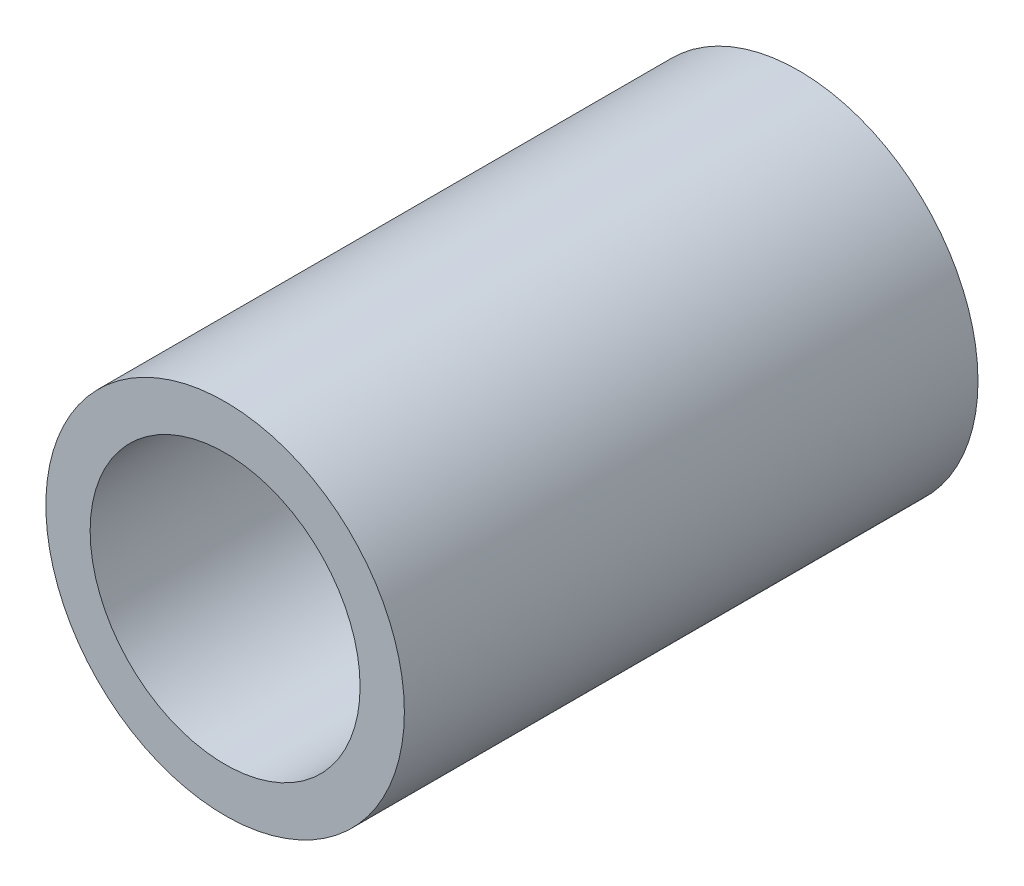
ISO-10303-21;
HEADER;
FILE_DESCRIPTION(('STEP AP214'),'2;1');
FILE_NAME('part.step','',(''),(''),'','','');
FILE_SCHEMA(('AUTOMOTIVE_DESIGN { 1 0 10303 214 1 1 1 1 }'));
ENDSEC;
DATA;
#1=APPLICATION_CONTEXT('core data for automotive mechanical design processes');
#2=APPLICATION_PROTOCOL_DEFINITION('international standard','automotive_design',2000,#1);
#3=PRODUCT_CONTEXT('',#1,'mechanical');
#4=PRODUCT('Part','Part','',(#3));
#5=PRODUCT_RELATED_PRODUCT_CATEGORY('part','',(#4));
#6=PRODUCT_DEFINITION_FORMATION('','',#4);
#7=PRODUCT_DEFINITION_CONTEXT('part definition',#1,'design');
#8=PRODUCT_DEFINITION('design','',#6,#7);
#9=PRODUCT_DEFINITION_SHAPE('','',#8);
#10=(LENGTH_UNIT() NAMED_UNIT(*) SI_UNIT(.MILLI.,.METRE.));
#11=(NAMED_UNIT(*) PLANE_ANGLE_UNIT() SI_UNIT($,.RADIAN.));
#12=(NAMED_UNIT(*) SI_UNIT($,.STERADIAN.) SOLID_ANGLE_UNIT());
#13=UNCERTAINTY_MEASURE_WITH_UNIT(LENGTH_MEASURE(1.E-05),#10,'distance_accuracy_value','');
#14=(GEOMETRIC_REPRESENTATION_CONTEXT(3) GLOBAL_UNCERTAINTY_ASSIGNED_CONTEXT((#13)) GLOBAL_UNIT_ASSIGNED_CONTEXT((#10,
#11,#12)) REPRESENTATION_CONTEXT('',''));
#15=CARTESIAN_POINT('',(0.,0.,0.));
#16=DIRECTION('',(0.,0.,1.));
#17=DIRECTION('',(1.,0.,0.));
#18=AXIS2_PLACEMENT_3D('',#15,#16,#17);
#19=CARTESIAN_POINT('',(0.,0.,34.));
#20=DIRECTION('',(0.,0.,1.));
#21=DIRECTION('',(1.,0.,0.));
#22=AXIS2_PLACEMENT_3D('',#19,#20,#21);
#23=PLANE('',#22);
#24=CARTESIAN_POINT('',(0.,0.,34.));
#25=DIRECTION('',(0.,0.,1.));
#26=DIRECTION('',(1.,0.,0.));
#27=AXIS2_PLACEMENT_3D('',#24,#25,#26);
#28=CIRCLE('',#27,21.25);
#29=CARTESIAN_POINT('',(21.25,0.,34.));
#30=VERTEX_POINT('',#29);
#31=EDGE_CURVE('E10',#30,#30,#28,.T.);
#32=ORIENTED_EDGE('',*,*,#31,.T.);
#33=EDGE_LOOP('',(#32));
#34=FACE_BOUND('',#33,.T.);
#35=CARTESIAN_POINT('',(0.,0.,34.));
#36=DIRECTION('',(0.,0.,1.));
#37=DIRECTION('',(1.,0.,0.));
#38=AXIS2_PLACEMENT_3D('',#35,#36,#37);
#39=CIRCLE('',#38,16.);
#40=CARTESIAN_POINT('',(16.,0.,34.));
#41=VERTEX_POINT('',#40);
#42=EDGE_CURVE('E35',#41,#41,#39,.T.);
#43=ORIENTED_EDGE('',*,*,#42,.F.);
#44=EDGE_LOOP('',(#43));
#45=FACE_BOUND('',#44,.T.);
#46=ADVANCED_FACE('F24',(#34,#45),#23,.T.);
#47=CARTESIAN_POINT('',(0.,0.,-34.));
#48=DIRECTION('',(0.,0.,1.));
#49=DIRECTION('',(1.,0.,0.));
#50=AXIS2_PLACEMENT_3D('',#47,#48,#49);
#51=PLANE('',#50);
#52=CARTESIAN_POINT('',(0.,0.,-34.));
#53=DIRECTION('',(0.,0.,1.));
#54=DIRECTION('',(1.,0.,0.));
#55=AXIS2_PLACEMENT_3D('',#52,#53,#54);
#56=CIRCLE('',#55,21.25);
#57=CARTESIAN_POINT('',(21.25,0.,-34.));
#58=VERTEX_POINT('',#57);
#59=EDGE_CURVE('E31',#58,#58,#56,.T.);
#60=ORIENTED_EDGE('',*,*,#59,.F.);
#61=EDGE_LOOP('',(#60));
#62=FACE_BOUND('',#61,.T.);
#63=CARTESIAN_POINT('',(0.,0.,-34.));
#64=DIRECTION('',(0.,0.,1.));
#65=DIRECTION('',(1.,0.,0.));
#66=AXIS2_PLACEMENT_3D('',#63,#64,#65);
#67=CIRCLE('',#66,16.);
#68=CARTESIAN_POINT('',(16.,0.,-34.));
#69=VERTEX_POINT('',#68);
#70=EDGE_CURVE('E39',#69,#69,#67,.T.);
#71=ORIENTED_EDGE('',*,*,#70,.T.);
#72=EDGE_LOOP('',(#71));
#73=FACE_BOUND('',#72,.T.);
#74=ADVANCED_FACE('F45',(#62,#73),#51,.F.);
#75=CARTESIAN_POINT('',(0.,0.,34.));
#76=DIRECTION('',(0.,0.,-1.));
#77=DIRECTION('',(-1.,0.,0.));
#78=AXIS2_PLACEMENT_3D('',#75,#76,#77);
#79=CYLINDRICAL_SURFACE('',#78,21.25);
#80=ORIENTED_EDGE('',*,*,#31,.F.);
#81=EDGE_LOOP('',(#80));
#82=FACE_BOUND('',#81,.T.);
#83=ORIENTED_EDGE('',*,*,#59,.T.);
#84=EDGE_LOOP('',(#83));
#85=FACE_BOUND('',#84,.T.);
#86=ADVANCED_FACE('F26',(#82,#85),#79,.T.);
#87=CARTESIAN_POINT('',(0.,0.,34.));
#88=DIRECTION('',(0.,0.,-1.));
#89=DIRECTION('',(-1.,0.,0.));
#90=AXIS2_PLACEMENT_3D('',#87,#88,#89);
#91=CYLINDRICAL_SURFACE('',#90,16.);
#92=ORIENTED_EDGE('',*,*,#42,.T.);
#93=EDGE_LOOP('',(#92));
#94=FACE_BOUND('',#93,.T.);
#95=ORIENTED_EDGE('',*,*,#70,.F.);
#96=EDGE_LOOP('',(#95));
#97=FACE_BOUND('',#96,.T.);
#98=ADVANCED_FACE('F47',(#94,#97),#91,.F.);
#99=CLOSED_SHELL('',(#46,#74,#86,#98));
#100=MANIFOLD_SOLID_BREP('B2',#99);
#101=ADVANCED_BREP_SHAPE_REPRESENTATION('',(#18,#100),#14);
#102=SHAPE_DEFINITION_REPRESENTATION(#9,#101);
ENDSEC;
END-ISO-10303-21;
